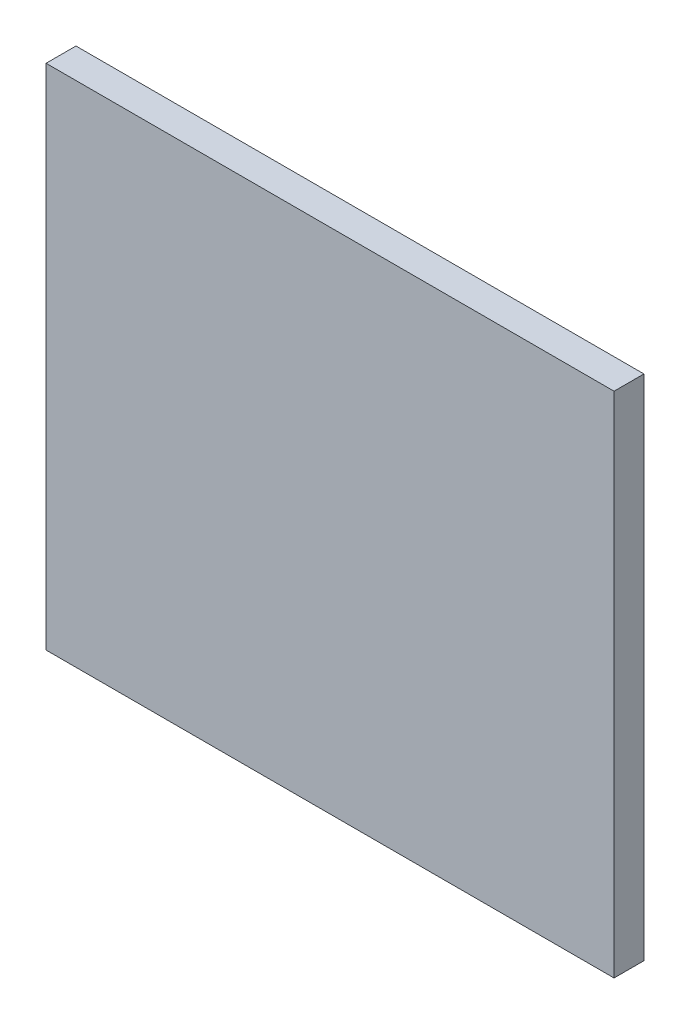
ISO-10303-21;
HEADER;
FILE_DESCRIPTION(('STEP AP214'),'2;1');
FILE_NAME('part.step','',(''),(''),'','','');
FILE_SCHEMA(('AUTOMOTIVE_DESIGN { 1 0 10303 214 1 1 1 1 }'));
ENDSEC;
DATA;
#1=APPLICATION_CONTEXT('core data for automotive mechanical design processes');
#2=APPLICATION_PROTOCOL_DEFINITION('international standard','automotive_design',2000,#1);
#3=PRODUCT_CONTEXT('',#1,'mechanical');
#4=PRODUCT('Part','Part','',(#3));
#5=PRODUCT_RELATED_PRODUCT_CATEGORY('part','',(#4));
#6=PRODUCT_DEFINITION_FORMATION('','',#4);
#7=PRODUCT_DEFINITION_CONTEXT('part definition',#1,'design');
#8=PRODUCT_DEFINITION('design','',#6,#7);
#9=PRODUCT_DEFINITION_SHAPE('','',#8);
#10=(LENGTH_UNIT() NAMED_UNIT(*) SI_UNIT(.MILLI.,.METRE.));
#11=(NAMED_UNIT(*) PLANE_ANGLE_UNIT() SI_UNIT($,.RADIAN.));
#12=(NAMED_UNIT(*) SI_UNIT($,.STERADIAN.) SOLID_ANGLE_UNIT());
#13=UNCERTAINTY_MEASURE_WITH_UNIT(LENGTH_MEASURE(1.E-05),#10,'distance_accuracy_value','');
#14=(GEOMETRIC_REPRESENTATION_CONTEXT(3) GLOBAL_UNCERTAINTY_ASSIGNED_CONTEXT((#13)) GLOBAL_UNIT_ASSIGNED_CONTEXT((#10,
#11,#12)) REPRESENTATION_CONTEXT('',''));
#15=CARTESIAN_POINT('',(0.,0.,0.));
#16=DIRECTION('',(0.,0.,1.));
#17=DIRECTION('',(1.,0.,0.));
#18=AXIS2_PLACEMENT_3D('',#15,#16,#17);
#19=CARTESIAN_POINT('',(-0.475,-0.425,0.45));
#20=DIRECTION('',(0.,0.,-1.));
#21=DIRECTION('',(0.,-1.,0.));
#22=AXIS2_PLACEMENT_3D('',#19,#20,#21);
#23=PLANE('',#22);
#24=DIRECTION('',(-1.,0.,0.));
#25=VECTOR('',#24,1.);
#26=CARTESIAN_POINT('',(-0.625,-0.425,0.45));
#27=LINE('',#26,#25);
#28=CARTESIAN_POINT('',(0.475,-0.425,0.45));
#29=VERTEX_POINT('',#28);
#30=CARTESIAN_POINT('',(-0.475,-0.425,0.45));
#31=VERTEX_POINT('',#30);
#32=EDGE_CURVE('E11',#29,#31,#27,.T.);
#33=ORIENTED_EDGE('',*,*,#32,.T.);
#34=DIRECTION('',(0.,-1.,0.));
#35=VECTOR('',#34,1.);
#36=CARTESIAN_POINT('',(-0.475,0.425,0.45));
#37=LINE('',#36,#35);
#38=CARTESIAN_POINT('',(-0.475,0.425,0.45));
#39=VERTEX_POINT('',#38);
#40=EDGE_CURVE('E40',#39,#31,#37,.T.);
#41=ORIENTED_EDGE('',*,*,#40,.F.);
#42=DIRECTION('',(1.,0.,0.));
#43=VECTOR('',#42,1.);
#44=CARTESIAN_POINT('',(0.15,0.425,0.45));
#45=LINE('',#44,#43);
#46=CARTESIAN_POINT('',(0.475,0.425,0.45));
#47=VERTEX_POINT('',#46);
#48=EDGE_CURVE('E20',#39,#47,#45,.T.);
#49=ORIENTED_EDGE('',*,*,#48,.T.);
#50=DIRECTION('',(0.,1.,0.));
#51=VECTOR('',#50,1.);
#52=CARTESIAN_POINT('',(0.475,0.425,0.45));
#53=LINE('',#52,#51);
#54=EDGE_CURVE('E84',#29,#47,#53,.T.);
#55=ORIENTED_EDGE('',*,*,#54,.F.);
#56=EDGE_LOOP('',(#33,#41,#49,#55));
#57=FACE_BOUND('',#56,.T.);
#58=ADVANCED_FACE('F16',(#57),#23,.T.);
#59=CARTESIAN_POINT('',(0.775,0.425,0.));
#60=DIRECTION('',(0.,1.,0.));
#61=DIRECTION('',(1.,0.,0.));
#62=AXIS2_PLACEMENT_3D('',#59,#60,#61);
#63=PLANE('',#62);
#64=ORIENTED_EDGE('',*,*,#48,.F.);
#65=DIRECTION('',(0.,0.,-1.));
#66=VECTOR('',#65,1.);
#67=CARTESIAN_POINT('',(-0.475,0.425,0.2));
#68=LINE('',#67,#66);
#69=CARTESIAN_POINT('',(-0.475,0.425,0.5));
#70=VERTEX_POINT('',#69);
#71=EDGE_CURVE('E71',#70,#39,#68,.T.);
#72=ORIENTED_EDGE('',*,*,#71,.F.);
#73=DIRECTION('',(-1.,0.,0.));
#74=VECTOR('',#73,1.);
#75=CARTESIAN_POINT('',(0.775,0.425,0.5));
#76=LINE('',#75,#74);
#77=CARTESIAN_POINT('',(0.475,0.425,0.5));
#78=VERTEX_POINT('',#77);
#79=EDGE_CURVE('E66',#78,#70,#76,.T.);
#80=ORIENTED_EDGE('',*,*,#79,.F.);
#81=DIRECTION('',(0.,0.,1.));
#82=VECTOR('',#81,1.);
#83=CARTESIAN_POINT('',(0.475,0.425,0.25));
#84=LINE('',#83,#82);
#85=EDGE_CURVE('E70',#47,#78,#84,.T.);
#86=ORIENTED_EDGE('',*,*,#85,.F.);
#87=EDGE_LOOP('',(#64,#72,#80,#86));
#88=FACE_BOUND('',#87,.T.);
#89=ADVANCED_FACE('F69',(#88),#63,.T.);
#90=CARTESIAN_POINT('',(-0.475,0.425,0.4));
#91=DIRECTION('',(-1.,0.,0.));
#92=DIRECTION('',(0.,1.,0.));
#93=AXIS2_PLACEMENT_3D('',#90,#91,#92);
#94=PLANE('',#93);
#95=DIRECTION('',(0.,0.,1.));
#96=VECTOR('',#95,1.);
#97=CARTESIAN_POINT('',(-0.475,-0.425,0.2));
#98=LINE('',#97,#96);
#99=CARTESIAN_POINT('',(-0.475,-0.425,0.5));
#100=VERTEX_POINT('',#99);
#101=EDGE_CURVE('E97',#31,#100,#98,.T.);
#102=ORIENTED_EDGE('',*,*,#101,.T.);
#103=DIRECTION('',(0.,1.,0.));
#104=VECTOR('',#103,1.);
#105=CARTESIAN_POINT('',(-0.475,0.2125,0.5));
#106=LINE('',#105,#104);
#107=EDGE_CURVE('E100',#100,#70,#106,.T.);
#108=ORIENTED_EDGE('',*,*,#107,.T.);
#109=ORIENTED_EDGE('',*,*,#71,.T.);
#110=ORIENTED_EDGE('',*,*,#40,.T.);
#111=EDGE_LOOP('',(#102,#108,#109,#110));
#112=FACE_BOUND('',#111,.T.);
#113=ADVANCED_FACE('F118',(#112),#94,.T.);
#114=CARTESIAN_POINT('',(0.475,0.425,0.5));
#115=DIRECTION('',(1.,0.,0.));
#116=DIRECTION('',(0.,1.,0.));
#117=AXIS2_PLACEMENT_3D('',#114,#115,#116);
#118=PLANE('',#117);
#119=DIRECTION('',(0.,0.,-1.));
#120=VECTOR('',#119,1.);
#121=CARTESIAN_POINT('',(0.475,-0.425,0.25));
#122=LINE('',#121,#120);
#123=CARTESIAN_POINT('',(0.475,-0.425,0.5));
#124=VERTEX_POINT('',#123);
#125=EDGE_CURVE('E102',#124,#29,#122,.T.);
#126=ORIENTED_EDGE('',*,*,#125,.T.);
#127=ORIENTED_EDGE('',*,*,#54,.T.);
#128=ORIENTED_EDGE('',*,*,#85,.T.);
#129=DIRECTION('',(0.,-1.,0.));
#130=VECTOR('',#129,1.);
#131=CARTESIAN_POINT('',(0.475,0.2125,0.5));
#132=LINE('',#131,#130);
#133=EDGE_CURVE('E76',#78,#124,#132,.T.);
#134=ORIENTED_EDGE('',*,*,#133,.T.);
#135=EDGE_LOOP('',(#126,#127,#128,#134));
#136=FACE_BOUND('',#135,.T.);
#137=ADVANCED_FACE('F81',(#136),#118,.T.);
#138=CARTESIAN_POINT('',(0.,0.,0.5));
#139=DIRECTION('',(0.,0.,1.));
#140=DIRECTION('',(1.,0.,0.));
#141=AXIS2_PLACEMENT_3D('',#138,#139,#140);
#142=PLANE('',#141);
#143=ORIENTED_EDGE('',*,*,#133,.F.);
#144=ORIENTED_EDGE('',*,*,#79,.T.);
#145=ORIENTED_EDGE('',*,*,#107,.F.);
#146=DIRECTION('',(1.,0.,0.));
#147=VECTOR('',#146,1.);
#148=CARTESIAN_POINT('',(-0.775,-0.425,0.5));
#149=LINE('',#148,#147);
#150=EDGE_CURVE('E77',#100,#124,#149,.T.);
#151=ORIENTED_EDGE('',*,*,#150,.T.);
#152=EDGE_LOOP('',(#143,#144,#145,#151));
#153=FACE_BOUND('',#152,.T.);
#154=ADVANCED_FACE('F88',(#153),#142,.T.);
#155=CARTESIAN_POINT('',(-0.775,-0.425,0.));
#156=DIRECTION('',(0.,-1.,0.));
#157=DIRECTION('',(0.,0.,-1.));
#158=AXIS2_PLACEMENT_3D('',#155,#156,#157);
#159=PLANE('',#158);
#160=ORIENTED_EDGE('',*,*,#32,.F.);
#161=ORIENTED_EDGE('',*,*,#125,.F.);
#162=ORIENTED_EDGE('',*,*,#150,.F.);
#163=ORIENTED_EDGE('',*,*,#101,.F.);
#164=EDGE_LOOP('',(#160,#161,#162,#163));
#165=FACE_BOUND('',#164,.T.);
#166=ADVANCED_FACE('F18',(#165),#159,.T.);
#167=CLOSED_SHELL('',(#58,#89,#113,#137,#154,#166));
#168=MANIFOLD_SOLID_BREP('B1',#167);
#169=ADVANCED_BREP_SHAPE_REPRESENTATION('',(#18,#168),#14);
#170=SHAPE_DEFINITION_REPRESENTATION(#9,#169);
ENDSEC;
END-ISO-10303-21;
